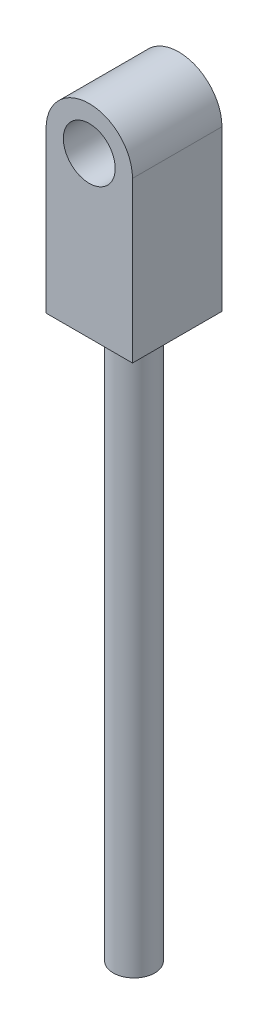
ISO-10303-21;
HEADER;
FILE_DESCRIPTION(('STEP AP214'),'2;1');
FILE_NAME('part.step','',(''),(''),'','','');
FILE_SCHEMA(('AUTOMOTIVE_DESIGN { 1 0 10303 214 1 1 1 1 }'));
ENDSEC;
DATA;
#1=APPLICATION_CONTEXT('core data for automotive mechanical design processes');
#2=APPLICATION_PROTOCOL_DEFINITION('international standard','automotive_design',2000,#1);
#3=PRODUCT_CONTEXT('',#1,'mechanical');
#4=PRODUCT('Part','Part','',(#3));
#5=PRODUCT_RELATED_PRODUCT_CATEGORY('part','',(#4));
#6=PRODUCT_DEFINITION_FORMATION('','',#4);
#7=PRODUCT_DEFINITION_CONTEXT('part definition',#1,'design');
#8=PRODUCT_DEFINITION('design','',#6,#7);
#9=PRODUCT_DEFINITION_SHAPE('','',#8);
#10=(LENGTH_UNIT() NAMED_UNIT(*) SI_UNIT(.MILLI.,.METRE.));
#11=(NAMED_UNIT(*) PLANE_ANGLE_UNIT() SI_UNIT($,.RADIAN.));
#12=(NAMED_UNIT(*) SI_UNIT($,.STERADIAN.) SOLID_ANGLE_UNIT());
#13=UNCERTAINTY_MEASURE_WITH_UNIT(LENGTH_MEASURE(1.E-05),#10,'distance_accuracy_value','');
#14=(GEOMETRIC_REPRESENTATION_CONTEXT(3) GLOBAL_UNCERTAINTY_ASSIGNED_CONTEXT((#13)) GLOBAL_UNIT_ASSIGNED_CONTEXT((#10,
#11,#12)) REPRESENTATION_CONTEXT('',''));
#15=CARTESIAN_POINT('',(0.,0.,0.));
#16=DIRECTION('',(0.,0.,1.));
#17=DIRECTION('',(1.,0.,0.));
#18=AXIS2_PLACEMENT_3D('',#15,#16,#17);
#19=CARTESIAN_POINT('',(-2.5,-9.25,-3.45));
#20=DIRECTION('',(0.,-1.,0.));
#21=DIRECTION('',(0.,0.,-1.));
#22=AXIS2_PLACEMENT_3D('',#19,#20,#21);
#23=PLANE('',#22);
#24=DIRECTION('',(0.,0.,1.));
#25=VECTOR('',#24,1.);
#26=CARTESIAN_POINT('',(2.50000000000001,-9.25,-3.45));
#27=LINE('',#26,#25);
#28=CARTESIAN_POINT('',(2.50000000000001,-9.25,-3.45));
#29=VERTEX_POINT('',#28);
#30=CARTESIAN_POINT('',(2.50000000000001,-9.25,1.725));
#31=VERTEX_POINT('',#30);
#32=EDGE_CURVE('E45',#29,#31,#27,.T.);
#33=ORIENTED_EDGE('',*,*,#32,.T.);
#34=DIRECTION('',(1.,0.,0.));
#35=VECTOR('',#34,1.);
#36=CARTESIAN_POINT('',(-2.5,-9.25,1.725));
#37=LINE('',#36,#35);
#38=CARTESIAN_POINT('',(-2.5,-9.25,1.725));
#39=VERTEX_POINT('',#38);
#40=EDGE_CURVE('E90',#39,#31,#37,.T.);
#41=ORIENTED_EDGE('',*,*,#40,.F.);
#42=DIRECTION('',(0.,0.,1.));
#43=VECTOR('',#42,1.);
#44=CARTESIAN_POINT('',(-2.5,-9.25,-3.45));
#45=LINE('',#44,#43);
#46=CARTESIAN_POINT('',(-2.5,-9.25,-3.45));
#47=VERTEX_POINT('',#46);
#48=EDGE_CURVE('E82',#47,#39,#45,.T.);
#49=ORIENTED_EDGE('',*,*,#48,.F.);
#50=DIRECTION('',(1.,0.,0.));
#51=VECTOR('',#50,1.);
#52=CARTESIAN_POINT('',(-2.5,-9.25,-3.45));
#53=LINE('',#52,#51);
#54=EDGE_CURVE('E111',#47,#29,#53,.T.);
#55=ORIENTED_EDGE('',*,*,#54,.T.);
#56=EDGE_LOOP('',(#33,#41,#49,#55));
#57=FACE_BOUND('',#56,.T.);
#58=CARTESIAN_POINT('',(0.,-9.25,-0.8625));
#59=DIRECTION('',(0.,-1.,0.));
#60=DIRECTION('',(0.,0.,-1.));
#61=AXIS2_PLACEMENT_3D('',#58,#59,#60);
#62=CIRCLE('',#61,1.203);
#63=CARTESIAN_POINT('',(0.,-9.25,-2.0655));
#64=VERTEX_POINT('',#63);
#65=EDGE_CURVE('E194',#64,#64,#62,.T.);
#66=ORIENTED_EDGE('',*,*,#65,.F.);
#67=EDGE_LOOP('',(#66));
#68=FACE_BOUND('',#67,.T.);
#69=ADVANCED_FACE('F36',(#57,#68),#23,.T.);
#70=CARTESIAN_POINT('',(0.,0.,-3.45));
#71=DIRECTION('',(0.,0.,1.));
#72=DIRECTION('',(1.,0.,0.));
#73=AXIS2_PLACEMENT_3D('',#70,#71,#72);
#74=CYLINDRICAL_SURFACE('',#73,2.50000000000001);
#75=DIRECTION('',(0.,0.,1.));
#76=VECTOR('',#75,1.);
#77=CARTESIAN_POINT('',(-2.5,0.,-3.45));
#78=LINE('',#77,#76);
#79=CARTESIAN_POINT('',(-2.5,0.,-3.45));
#80=VERTEX_POINT('',#79);
#81=CARTESIAN_POINT('',(-2.5,0.,1.725));
#82=VERTEX_POINT('',#81);
#83=EDGE_CURVE('E40',#80,#82,#78,.T.);
#84=ORIENTED_EDGE('',*,*,#83,.T.);
#85=CARTESIAN_POINT('',(0.,0.,1.725));
#86=DIRECTION('',(0.,0.,1.));
#87=DIRECTION('',(1.,0.,0.));
#88=AXIS2_PLACEMENT_3D('',#85,#86,#87);
#89=CIRCLE('',#88,2.50000000000001);
#90=CARTESIAN_POINT('',(2.50000000000001,0.,1.725));
#91=VERTEX_POINT('',#90);
#92=EDGE_CURVE('E77',#91,#82,#89,.T.);
#93=ORIENTED_EDGE('',*,*,#92,.F.);
#94=DIRECTION('',(0.,0.,1.));
#95=VECTOR('',#94,1.);
#96=CARTESIAN_POINT('',(2.50000000000001,0.,-3.45));
#97=LINE('',#96,#95);
#98=CARTESIAN_POINT('',(2.50000000000001,0.,-3.45));
#99=VERTEX_POINT('',#98);
#100=EDGE_CURVE('E11',#99,#91,#97,.T.);
#101=ORIENTED_EDGE('',*,*,#100,.F.);
#102=CARTESIAN_POINT('',(0.,0.,-3.45));
#103=DIRECTION('',(0.,0.,1.));
#104=DIRECTION('',(1.,0.,0.));
#105=AXIS2_PLACEMENT_3D('',#102,#103,#104);
#106=CIRCLE('',#105,2.50000000000001);
#107=EDGE_CURVE('E78',#99,#80,#106,.T.);
#108=ORIENTED_EDGE('',*,*,#107,.T.);
#109=EDGE_LOOP('',(#84,#93,#101,#108));
#110=FACE_BOUND('',#109,.T.);
#111=ADVANCED_FACE('F38',(#110),#74,.T.);
#112=CARTESIAN_POINT('',(2.50000000000001,0.,-3.45));
#113=DIRECTION('',(1.,0.,0.));
#114=DIRECTION('',(0.,1.,0.));
#115=AXIS2_PLACEMENT_3D('',#112,#113,#114);
#116=PLANE('',#115);
#117=ORIENTED_EDGE('',*,*,#100,.T.);
#118=DIRECTION('',(0.,1.,0.));
#119=VECTOR('',#118,1.);
#120=CARTESIAN_POINT('',(2.50000000000001,0.,1.725));
#121=LINE('',#120,#119);
#122=EDGE_CURVE('E95',#31,#91,#121,.T.);
#123=ORIENTED_EDGE('',*,*,#122,.F.);
#124=ORIENTED_EDGE('',*,*,#32,.F.);
#125=DIRECTION('',(0.,1.,0.));
#126=VECTOR('',#125,1.);
#127=CARTESIAN_POINT('',(2.50000000000001,0.,-3.45));
#128=LINE('',#127,#126);
#129=EDGE_CURVE('E83',#29,#99,#128,.T.);
#130=ORIENTED_EDGE('',*,*,#129,.T.);
#131=EDGE_LOOP('',(#117,#123,#124,#130));
#132=FACE_BOUND('',#131,.T.);
#133=ADVANCED_FACE('F118',(#132),#116,.T.);
#134=CARTESIAN_POINT('',(-2.5,0.,-3.45));
#135=DIRECTION('',(-1.,0.,0.));
#136=DIRECTION('',(0.,-1.,0.));
#137=AXIS2_PLACEMENT_3D('',#134,#135,#136);
#138=PLANE('',#137);
#139=ORIENTED_EDGE('',*,*,#48,.T.);
#140=DIRECTION('',(0.,-1.,0.));
#141=VECTOR('',#140,1.);
#142=CARTESIAN_POINT('',(-2.5,0.,1.725));
#143=LINE('',#142,#141);
#144=EDGE_CURVE('E85',#82,#39,#143,.T.);
#145=ORIENTED_EDGE('',*,*,#144,.F.);
#146=ORIENTED_EDGE('',*,*,#83,.F.);
#147=DIRECTION('',(0.,-1.,0.));
#148=VECTOR('',#147,1.);
#149=CARTESIAN_POINT('',(-2.5,0.,-3.45));
#150=LINE('',#149,#148);
#151=EDGE_CURVE('E109',#80,#47,#150,.T.);
#152=ORIENTED_EDGE('',*,*,#151,.T.);
#153=EDGE_LOOP('',(#139,#145,#146,#152));
#154=FACE_BOUND('',#153,.T.);
#155=ADVANCED_FACE('F86',(#154),#138,.T.);
#156=CARTESIAN_POINT('',(0.,0.,-3.45));
#157=DIRECTION('',(0.,0.,1.));
#158=DIRECTION('',(1.,0.,0.));
#159=AXIS2_PLACEMENT_3D('',#156,#157,#158);
#160=PLANE('',#159);
#161=CARTESIAN_POINT('',(0.,0.,-3.45));
#162=DIRECTION('',(0.,0.,1.));
#163=DIRECTION('',(1.,0.,0.));
#164=AXIS2_PLACEMENT_3D('',#161,#162,#163);
#165=CIRCLE('',#164,1.5);
#166=CARTESIAN_POINT('',(1.5,0.,-3.45));
#167=VERTEX_POINT('',#166);
#168=EDGE_CURVE('E105',#167,#167,#165,.T.);
#169=ORIENTED_EDGE('',*,*,#168,.T.);
#170=EDGE_LOOP('',(#169));
#171=FACE_BOUND('',#170,.T.);
#172=ORIENTED_EDGE('',*,*,#107,.F.);
#173=ORIENTED_EDGE('',*,*,#129,.F.);
#174=ORIENTED_EDGE('',*,*,#54,.F.);
#175=ORIENTED_EDGE('',*,*,#151,.F.);
#176=EDGE_LOOP('',(#172,#173,#174,#175));
#177=FACE_BOUND('',#176,.T.);
#178=ADVANCED_FACE('F120',(#171,#177),#160,.F.);
#179=CARTESIAN_POINT('',(0.,0.,-3.45));
#180=DIRECTION('',(0.,0.,1.));
#181=DIRECTION('',(1.,0.,0.));
#182=AXIS2_PLACEMENT_3D('',#179,#180,#181);
#183=CYLINDRICAL_SURFACE('',#182,1.5);
#184=ORIENTED_EDGE('',*,*,#168,.F.);
#185=EDGE_LOOP('',(#184));
#186=FACE_BOUND('',#185,.T.);
#187=CARTESIAN_POINT('',(0.,0.,1.725));
#188=DIRECTION('',(0.,0.,1.));
#189=DIRECTION('',(1.,0.,0.));
#190=AXIS2_PLACEMENT_3D('',#187,#188,#189);
#191=CIRCLE('',#190,1.5);
#192=CARTESIAN_POINT('',(1.5,0.,1.725));
#193=VERTEX_POINT('',#192);
#194=EDGE_CURVE('E96',#193,#193,#191,.T.);
#195=ORIENTED_EDGE('',*,*,#194,.T.);
#196=EDGE_LOOP('',(#195));
#197=FACE_BOUND('',#196,.T.);
#198=ADVANCED_FACE('F122',(#186,#197),#183,.F.);
#199=CARTESIAN_POINT('',(0.,0.,1.725));
#200=DIRECTION('',(0.,0.,1.));
#201=DIRECTION('',(1.,0.,0.));
#202=AXIS2_PLACEMENT_3D('',#199,#200,#201);
#203=PLANE('',#202);
#204=ORIENTED_EDGE('',*,*,#92,.T.);
#205=ORIENTED_EDGE('',*,*,#144,.T.);
#206=ORIENTED_EDGE('',*,*,#40,.T.);
#207=ORIENTED_EDGE('',*,*,#122,.T.);
#208=EDGE_LOOP('',(#204,#205,#206,#207));
#209=FACE_BOUND('',#208,.T.);
#210=ORIENTED_EDGE('',*,*,#194,.F.);
#211=EDGE_LOOP('',(#210));
#212=FACE_BOUND('',#211,.T.);
#213=ADVANCED_FACE('F93',(#209,#212),#203,.T.);
#214=CARTESIAN_POINT('',(0.,-41.75,-0.8625));
#215=DIRECTION('',(0.,1.,0.));
#216=DIRECTION('',(0.,0.,1.));
#217=AXIS2_PLACEMENT_3D('',#214,#215,#216);
#218=CYLINDRICAL_SURFACE('',#217,1.203);
#219=CARTESIAN_POINT('',(0.,-41.75,-0.8625));
#220=DIRECTION('',(0.,-1.,0.));
#221=DIRECTION('',(0.,0.,-1.));
#222=AXIS2_PLACEMENT_3D('',#219,#220,#221);
#223=CIRCLE('',#222,1.203);
#224=CARTESIAN_POINT('',(0.,-41.75,-2.0655));
#225=VERTEX_POINT('',#224);
#226=EDGE_CURVE('E99',#225,#225,#223,.T.);
#227=ORIENTED_EDGE('',*,*,#226,.F.);
#228=EDGE_LOOP('',(#227));
#229=FACE_BOUND('',#228,.T.);
#230=ORIENTED_EDGE('',*,*,#65,.T.);
#231=EDGE_LOOP('',(#230));
#232=FACE_BOUND('',#231,.T.);
#233=ADVANCED_FACE('F164',(#229,#232),#218,.T.);
#234=CARTESIAN_POINT('',(0.,-41.75,-0.8625));
#235=DIRECTION('',(0.,-1.,0.));
#236=DIRECTION('',(0.,0.,-1.));
#237=AXIS2_PLACEMENT_3D('',#234,#235,#236);
#238=PLANE('',#237);
#239=ORIENTED_EDGE('',*,*,#226,.T.);
#240=EDGE_LOOP('',(#239));
#241=FACE_BOUND('',#240,.T.);
#242=ADVANCED_FACE('F178',(#241),#238,.T.);
#243=CLOSED_SHELL('',(#69,#111,#133,#155,#178,#198,#213,#233,#242));
#244=MANIFOLD_SOLID_BREP('B2',#243);
#245=ADVANCED_BREP_SHAPE_REPRESENTATION('',(#18,#244),#14);
#246=SHAPE_DEFINITION_REPRESENTATION(#9,#245);
ENDSEC;
END-ISO-10303-21;
